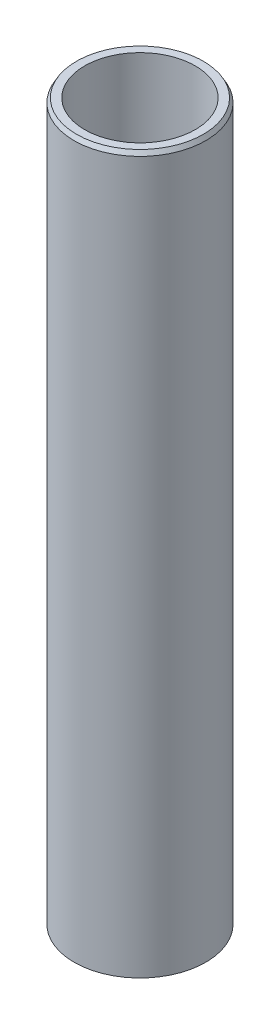
ISO-10303-21;
HEADER;
FILE_DESCRIPTION(('STEP AP214'),'2;1');
FILE_NAME('part.step','',(''),(''),'','','');
FILE_SCHEMA(('AUTOMOTIVE_DESIGN { 1 0 10303 214 1 1 1 1 }'));
ENDSEC;
DATA;
#1=APPLICATION_CONTEXT('core data for automotive mechanical design processes');
#2=APPLICATION_PROTOCOL_DEFINITION('international standard','automotive_design',2000,#1);
#3=PRODUCT_CONTEXT('',#1,'mechanical');
#4=PRODUCT('Part','Part','',(#3));
#5=PRODUCT_RELATED_PRODUCT_CATEGORY('part','',(#4));
#6=PRODUCT_DEFINITION_FORMATION('','',#4);
#7=PRODUCT_DEFINITION_CONTEXT('part definition',#1,'design');
#8=PRODUCT_DEFINITION('design','',#6,#7);
#9=PRODUCT_DEFINITION_SHAPE('','',#8);
#10=(LENGTH_UNIT() NAMED_UNIT(*) SI_UNIT(.MILLI.,.METRE.));
#11=(NAMED_UNIT(*) PLANE_ANGLE_UNIT() SI_UNIT($,.RADIAN.));
#12=(NAMED_UNIT(*) SI_UNIT($,.STERADIAN.) SOLID_ANGLE_UNIT());
#13=UNCERTAINTY_MEASURE_WITH_UNIT(LENGTH_MEASURE(1.E-05),#10,'distance_accuracy_value','');
#14=(GEOMETRIC_REPRESENTATION_CONTEXT(3) GLOBAL_UNCERTAINTY_ASSIGNED_CONTEXT((#13)) GLOBAL_UNIT_ASSIGNED_CONTEXT((#10,
#11,#12)) REPRESENTATION_CONTEXT('',''));
#15=CARTESIAN_POINT('',(0.,0.,0.));
#16=DIRECTION('',(0.,0.,1.));
#17=DIRECTION('',(1.,0.,0.));
#18=AXIS2_PLACEMENT_3D('',#15,#16,#17);
#19=CARTESIAN_POINT('',(0.,600.,0.));
#20=DIRECTION('',(0.,-1.,0.));
#21=DIRECTION('',(0.,0.,-1.));
#22=AXIS2_PLACEMENT_3D('',#19,#20,#21);
#23=CYLINDRICAL_SURFACE('',#22,55.);
#24=CARTESIAN_POINT('',(0.,596.446895614067,0.));
#25=DIRECTION('',(0.,1.,0.));
#26=DIRECTION('',(0.,0.,1.));
#27=AXIS2_PLACEMENT_3D('',#24,#25,#26);
#28=CIRCLE('',#27,55.);
#29=CARTESIAN_POINT('',(0.,596.446895614067,55.));
#30=VERTEX_POINT('',#29);
#31=EDGE_CURVE('E50',#30,#30,#28,.F.);
#32=ORIENTED_EDGE('',*,*,#31,.T.);
#33=EDGE_LOOP('',(#32));
#34=FACE_BOUND('',#33,.T.);
#35=CARTESIAN_POINT('',(0.,2.05138577367736,0.));
#36=DIRECTION('',(0.,1.,0.));
#37=DIRECTION('',(0.,0.,1.));
#38=AXIS2_PLACEMENT_3D('',#35,#36,#37);
#39=CIRCLE('',#38,55.);
#40=CARTESIAN_POINT('',(0.,2.05138577367736,55.));
#41=VERTEX_POINT('',#40);
#42=EDGE_CURVE('E51',#41,#41,#39,.T.);
#43=ORIENTED_EDGE('',*,*,#42,.T.);
#44=EDGE_LOOP('',(#43));
#45=FACE_BOUND('',#44,.T.);
#46=ADVANCED_FACE('F39',(#34,#45),#23,.T.);
#47=CARTESIAN_POINT('',(0.,600.,0.));
#48=DIRECTION('',(0.,1.,0.));
#49=DIRECTION('',(0.,0.,1.));
#50=AXIS2_PLACEMENT_3D('',#47,#48,#49);
#51=PLANE('',#50);
#52=CARTESIAN_POINT('',(0.,600.,0.));
#53=DIRECTION('',(0.,1.,0.));
#54=DIRECTION('',(0.,0.,1.));
#55=AXIS2_PLACEMENT_3D('',#52,#53,#54);
#56=CIRCLE('',#55,52.9486142263226);
#57=CARTESIAN_POINT('',(0.,600.,52.9486142263226));
#58=VERTEX_POINT('',#57);
#59=EDGE_CURVE('E54',#58,#58,#56,.T.);
#60=ORIENTED_EDGE('',*,*,#59,.T.);
#61=EDGE_LOOP('',(#60));
#62=FACE_BOUND('',#61,.T.);
#63=CARTESIAN_POINT('',(0.,600.,0.));
#64=DIRECTION('',(0.,1.,0.));
#65=DIRECTION('',(0.,0.,1.));
#66=AXIS2_PLACEMENT_3D('',#63,#64,#65);
#67=CIRCLE('',#66,46.1977725211277);
#68=CARTESIAN_POINT('',(0.,600.,46.1977725211277));
#69=VERTEX_POINT('',#68);
#70=EDGE_CURVE('E58',#69,#69,#67,.T.);
#71=ORIENTED_EDGE('',*,*,#70,.F.);
#72=EDGE_LOOP('',(#71));
#73=FACE_BOUND('',#72,.T.);
#74=ADVANCED_FACE('F69',(#62,#73),#51,.T.);
#75=CARTESIAN_POINT('',(0.,0.,0.));
#76=DIRECTION('',(0.,1.,0.));
#77=DIRECTION('',(0.,0.,1.));
#78=AXIS2_PLACEMENT_3D('',#75,#76,#77);
#79=PLANE('',#78);
#80=CARTESIAN_POINT('',(0.,0.,0.));
#81=DIRECTION('',(0.,1.,0.));
#82=DIRECTION('',(0.,0.,1.));
#83=AXIS2_PLACEMENT_3D('',#80,#81,#82);
#84=CIRCLE('',#83,51.4468956140668);
#85=CARTESIAN_POINT('',(0.,0.,51.4468956140668));
#86=VERTEX_POINT('',#85);
#87=EDGE_CURVE('E10',#86,#86,#84,.F.);
#88=ORIENTED_EDGE('',*,*,#87,.T.);
#89=EDGE_LOOP('',(#88));
#90=FACE_BOUND('',#89,.T.);
#91=CARTESIAN_POINT('',(0.,0.,0.));
#92=DIRECTION('',(0.,1.,0.));
#93=DIRECTION('',(0.,0.,1.));
#94=AXIS2_PLACEMENT_3D('',#91,#92,#93);
#95=CIRCLE('',#94,46.1977725211277);
#96=CARTESIAN_POINT('',(0.,0.,46.1977725211277));
#97=VERTEX_POINT('',#96);
#98=EDGE_CURVE('E63',#97,#97,#95,.T.);
#99=ORIENTED_EDGE('',*,*,#98,.T.);
#100=EDGE_LOOP('',(#99));
#101=FACE_BOUND('',#100,.T.);
#102=ADVANCED_FACE('F75',(#90,#101),#79,.F.);
#103=CARTESIAN_POINT('',(0.,600.,0.));
#104=DIRECTION('',(0.,-1.,0.));
#105=DIRECTION('',(0.,0.,-1.));
#106=AXIS2_PLACEMENT_3D('',#103,#104,#105);
#107=CYLINDRICAL_SURFACE('',#106,46.1977725211277);
#108=ORIENTED_EDGE('',*,*,#70,.T.);
#109=EDGE_LOOP('',(#108));
#110=FACE_BOUND('',#109,.T.);
#111=ORIENTED_EDGE('',*,*,#98,.F.);
#112=EDGE_LOOP('',(#111));
#113=FACE_BOUND('',#112,.T.);
#114=ADVANCED_FACE('F70',(#110,#113),#107,.F.);
#115=CARTESIAN_POINT('',(0.,600.,0.));
#116=DIRECTION('',(0.,-1.,0.));
#117=DIRECTION('',(0.,0.,-1.));
#118=AXIS2_PLACEMENT_3D('',#115,#116,#117);
#119=CONICAL_SURFACE('',#118,52.9486142263226,0.523598775598302);
#120=ORIENTED_EDGE('',*,*,#31,.F.);
#121=EDGE_LOOP('',(#120));
#122=FACE_BOUND('',#121,.T.);
#123=ORIENTED_EDGE('',*,*,#59,.F.);
#124=EDGE_LOOP('',(#123));
#125=FACE_BOUND('',#124,.T.);
#126=ADVANCED_FACE('F81',(#122,#125),#119,.T.);
#127=CARTESIAN_POINT('',(0.,2.05138577367736,0.));
#128=DIRECTION('',(0.,1.,0.));
#129=DIRECTION('',(0.,0.,1.));
#130=AXIS2_PLACEMENT_3D('',#127,#128,#129);
#131=CONICAL_SURFACE('',#130,55.,1.0471975511966);
#132=ORIENTED_EDGE('',*,*,#87,.F.);
#133=EDGE_LOOP('',(#132));
#134=FACE_BOUND('',#133,.T.);
#135=ORIENTED_EDGE('',*,*,#42,.F.);
#136=EDGE_LOOP('',(#135));
#137=FACE_BOUND('',#136,.T.);
#138=ADVANCED_FACE('F45',(#134,#137),#131,.T.);
#139=CLOSED_SHELL('',(#46,#74,#102,#114,#126,#138));
#140=MANIFOLD_SOLID_BREP('B2',#139);
#141=ADVANCED_BREP_SHAPE_REPRESENTATION('',(#18,#140),#14);
#142=SHAPE_DEFINITION_REPRESENTATION(#9,#141);
ENDSEC;
END-ISO-10303-21;
